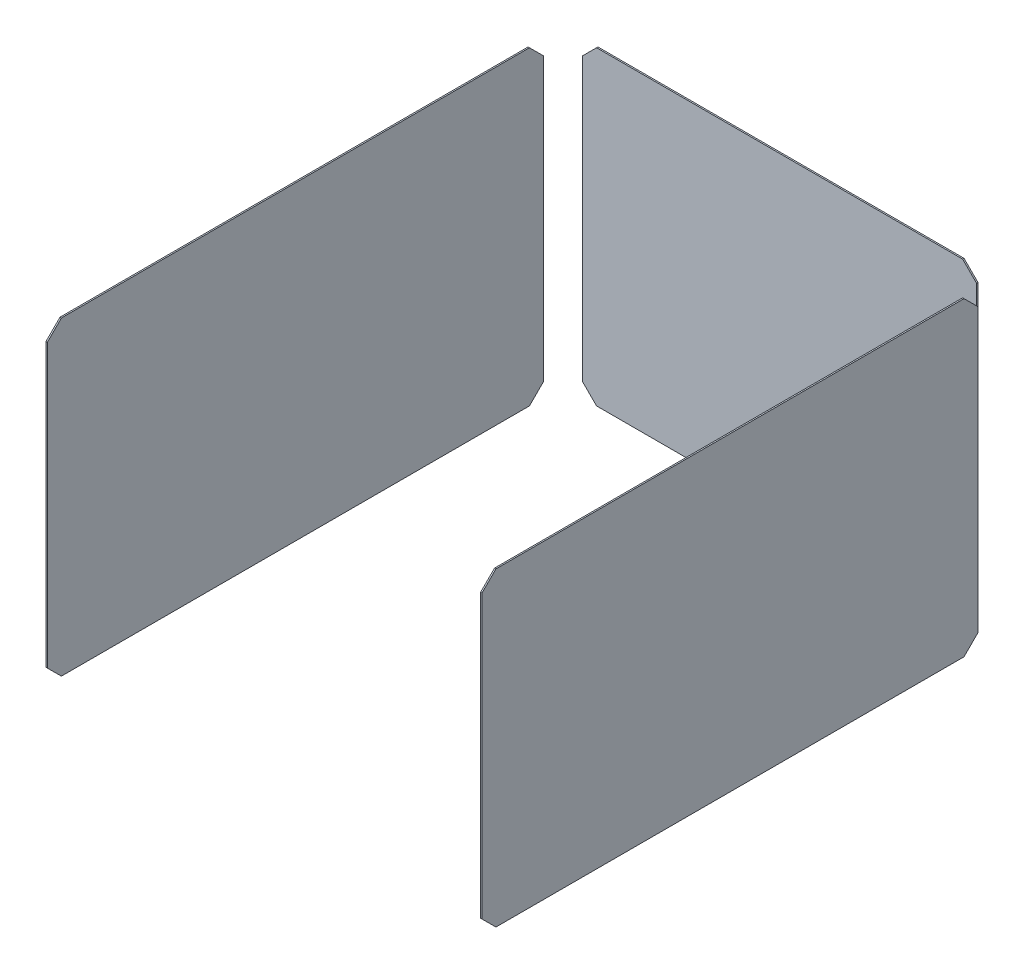
ISO-10303-21;
HEADER;
FILE_DESCRIPTION(('STEP AP214'),'2;1');
FILE_NAME('part.step','',(''),(''),'','','');
FILE_SCHEMA(('AUTOMOTIVE_DESIGN { 1 0 10303 214 1 1 1 1 }'));
ENDSEC;
DATA;
#1=APPLICATION_CONTEXT('core data for automotive mechanical design processes');
#2=APPLICATION_PROTOCOL_DEFINITION('international standard','automotive_design',2000,#1);
#3=PRODUCT_CONTEXT('',#1,'mechanical');
#4=PRODUCT('Part','Part','',(#3));
#5=PRODUCT_RELATED_PRODUCT_CATEGORY('part','',(#4));
#6=PRODUCT_DEFINITION_FORMATION('','',#4);
#7=PRODUCT_DEFINITION_CONTEXT('part definition',#1,'design');
#8=PRODUCT_DEFINITION('design','',#6,#7);
#9=PRODUCT_DEFINITION_SHAPE('','',#8);
#10=(LENGTH_UNIT() NAMED_UNIT(*) SI_UNIT(.MILLI.,.METRE.));
#11=(NAMED_UNIT(*) PLANE_ANGLE_UNIT() SI_UNIT($,.RADIAN.));
#12=(NAMED_UNIT(*) SI_UNIT($,.STERADIAN.) SOLID_ANGLE_UNIT());
#13=UNCERTAINTY_MEASURE_WITH_UNIT(LENGTH_MEASURE(1.E-05),#10,'distance_accuracy_value','');
#14=(GEOMETRIC_REPRESENTATION_CONTEXT(3) GLOBAL_UNCERTAINTY_ASSIGNED_CONTEXT((#13)) GLOBAL_UNIT_ASSIGNED_CONTEXT((#10,
#11,#12)) REPRESENTATION_CONTEXT('',''));
#15=CARTESIAN_POINT('',(0.,0.,0.));
#16=DIRECTION('',(0.,0.,1.));
#17=DIRECTION('',(1.,0.,0.));
#18=AXIS2_PLACEMENT_3D('',#15,#16,#17);
#19=CARTESIAN_POINT('',(3160.,2360.,-4000.));
#20=DIRECTION('',(0.,-1.,0.));
#21=DIRECTION('',(0.,0.,-1.));
#22=AXIS2_PLACEMENT_3D('',#19,#20,#21);
#23=PLANE('',#22);
#24=DIRECTION('',(0.,0.,-1.));
#25=VECTOR('',#24,1.);
#26=CARTESIAN_POINT('',(3110.,2360.,-3700.));
#27=LINE('',#26,#25);
#28=CARTESIAN_POINT('',(3110.,2360.,-100.));
#29=VERTEX_POINT('',#28);
#30=CARTESIAN_POINT('',(3110.,2360.,-3450.));
#31=VERTEX_POINT('',#30);
#32=EDGE_CURVE('E190',#29,#31,#27,.T.);
#33=ORIENTED_EDGE('',*,*,#32,.T.);
#34=DIRECTION('',(-1.,0.,0.));
#35=VECTOR('',#34,1.);
#36=CARTESIAN_POINT('',(3160.,2360.,-3450.));
#37=LINE('',#36,#35);
#38=CARTESIAN_POINT('',(3100.,2360.,-3450.));
#39=VERTEX_POINT('',#38);
#40=EDGE_CURVE('E181',#31,#39,#37,.T.);
#41=ORIENTED_EDGE('',*,*,#40,.T.);
#42=DIRECTION('',(0.,0.,-1.));
#43=VECTOR('',#42,1.);
#44=CARTESIAN_POINT('',(3100.,2360.,-3700.));
#45=LINE('',#44,#43);
#46=CARTESIAN_POINT('',(3100.,2360.,-99.9999999999994));
#47=VERTEX_POINT('',#46);
#48=EDGE_CURVE('E187',#47,#39,#45,.T.);
#49=ORIENTED_EDGE('',*,*,#48,.F.);
#50=DIRECTION('',(1.,0.,0.));
#51=VECTOR('',#50,1.);
#52=CARTESIAN_POINT('',(3110.,2360.,-100.));
#53=LINE('',#52,#51);
#54=EDGE_CURVE('E142',#47,#29,#53,.T.);
#55=ORIENTED_EDGE('',*,*,#54,.T.);
#56=EDGE_LOOP('',(#33,#41,#49,#55));
#57=FACE_BOUND('',#56,.T.);
#58=ADVANCED_FACE('F70',(#57),#23,.F.);
#59=CARTESIAN_POINT('',(-60.0000000000005,140.,-4000.));
#60=DIRECTION('',(0.,1.,0.));
#61=DIRECTION('',(0.,0.,1.));
#62=AXIS2_PLACEMENT_3D('',#59,#60,#61);
#63=PLANE('',#62);
#64=DIRECTION('',(0.,0.,1.));
#65=VECTOR('',#64,1.);
#66=CARTESIAN_POINT('',(3100.,140.,-3700.));
#67=LINE('',#66,#65);
#68=CARTESIAN_POINT('',(3100.,140.,-3450.));
#69=VERTEX_POINT('',#68);
#70=CARTESIAN_POINT('',(3100.,140.,-99.9999999999994));
#71=VERTEX_POINT('',#70);
#72=EDGE_CURVE('E136',#69,#71,#67,.T.);
#73=ORIENTED_EDGE('',*,*,#72,.F.);
#74=DIRECTION('',(1.,0.,0.));
#75=VECTOR('',#74,1.);
#76=CARTESIAN_POINT('',(-60.0000000000005,140.,-3450.));
#77=LINE('',#76,#75);
#78=CARTESIAN_POINT('',(3110.,140.,-3450.));
#79=VERTEX_POINT('',#78);
#80=EDGE_CURVE('E150',#69,#79,#77,.T.);
#81=ORIENTED_EDGE('',*,*,#80,.T.);
#82=DIRECTION('',(0.,0.,1.));
#83=VECTOR('',#82,1.);
#84=CARTESIAN_POINT('',(3110.,140.,-3700.));
#85=LINE('',#84,#83);
#86=CARTESIAN_POINT('',(3110.,140.,-100.));
#87=VERTEX_POINT('',#86);
#88=EDGE_CURVE('E207',#79,#87,#85,.T.);
#89=ORIENTED_EDGE('',*,*,#88,.T.);
#90=DIRECTION('',(-1.,0.,0.));
#91=VECTOR('',#90,1.);
#92=CARTESIAN_POINT('',(3100.,140.,-100.));
#93=LINE('',#92,#91);
#94=EDGE_CURVE('E153',#87,#71,#93,.T.);
#95=ORIENTED_EDGE('',*,*,#94,.T.);
#96=EDGE_LOOP('',(#73,#81,#89,#95));
#97=FACE_BOUND('',#96,.T.);
#98=ADVANCED_FACE('F148',(#97),#63,.F.);
#99=CARTESIAN_POINT('',(0.,0.,0.));
#100=DIRECTION('',(0.,0.,1.));
#101=DIRECTION('',(1.,0.,0.));
#102=AXIS2_PLACEMENT_3D('',#99,#100,#101);
#103=PLANE('',#102);
#104=DIRECTION('',(0.,1.,0.));
#105=VECTOR('',#104,1.);
#106=CARTESIAN_POINT('',(3100.,0.,0.));
#107=LINE('',#106,#105);
#108=CARTESIAN_POINT('',(3100.,240.,0.));
#109=VERTEX_POINT('',#108);
#110=CARTESIAN_POINT('',(3100.,2260.,0.));
#111=VERTEX_POINT('',#110);
#112=EDGE_CURVE('E154',#109,#111,#107,.T.);
#113=ORIENTED_EDGE('',*,*,#112,.F.);
#114=DIRECTION('',(1.,0.,0.));
#115=VECTOR('',#114,1.);
#116=CARTESIAN_POINT('',(3110.,240.,0.));
#117=LINE('',#116,#115);
#118=CARTESIAN_POINT('',(3110.,240.,-1.11022302462516E-13));
#119=VERTEX_POINT('',#118);
#120=EDGE_CURVE('E13',#109,#119,#117,.T.);
#121=ORIENTED_EDGE('',*,*,#120,.T.);
#122=DIRECTION('',(0.,1.,0.));
#123=VECTOR('',#122,1.);
#124=CARTESIAN_POINT('',(3110.,0.,0.));
#125=LINE('',#124,#123);
#126=CARTESIAN_POINT('',(3110.,2260.,0.));
#127=VERTEX_POINT('',#126);
#128=EDGE_CURVE('E194',#119,#127,#125,.T.);
#129=ORIENTED_EDGE('',*,*,#128,.T.);
#130=DIRECTION('',(-1.,0.,0.));
#131=VECTOR('',#130,1.);
#132=CARTESIAN_POINT('',(3100.,2260.,0.));
#133=LINE('',#132,#131);
#134=EDGE_CURVE('E78',#127,#111,#133,.T.);
#135=ORIENTED_EDGE('',*,*,#134,.T.);
#136=EDGE_LOOP('',(#113,#121,#129,#135));
#137=FACE_BOUND('',#136,.T.);
#138=ADVANCED_FACE('F215',(#137),#103,.T.);
#139=CARTESIAN_POINT('',(3100.,0.,-3700.));
#140=DIRECTION('',(1.,0.,0.));
#141=DIRECTION('',(0.,0.,-1.));
#142=AXIS2_PLACEMENT_3D('',#139,#140,#141);
#143=PLANE('',#142);
#144=DIRECTION('',(0.,-1.,0.));
#145=VECTOR('',#144,1.);
#146=CARTESIAN_POINT('',(3100.,0.,-3550.));
#147=LINE('',#146,#145);
#148=CARTESIAN_POINT('',(3100.,2260.,-3550.));
#149=VERTEX_POINT('',#148);
#150=CARTESIAN_POINT('',(3100.,240.000000000001,-3550.));
#151=VERTEX_POINT('',#150);
#152=EDGE_CURVE('E138',#149,#151,#147,.T.);
#153=ORIENTED_EDGE('',*,*,#152,.T.);
#154=DIRECTION('',(0.,0.707106781186551,-0.707106781186544));
#155=VECTOR('',#154,1.);
#156=CARTESIAN_POINT('',(3100.,140.,-3450.));
#157=LINE('',#156,#155);
#158=EDGE_CURVE('E133',#151,#69,#157,.F.);
#159=ORIENTED_EDGE('',*,*,#158,.T.);
#160=ORIENTED_EDGE('',*,*,#72,.T.);
#161=DIRECTION('',(0.,0.707106781186549,0.707106781186546));
#162=VECTOR('',#161,1.);
#163=CARTESIAN_POINT('',(3100.,140.,-100.));
#164=LINE('',#163,#162);
#165=EDGE_CURVE('E91',#71,#109,#164,.T.);
#166=ORIENTED_EDGE('',*,*,#165,.T.);
#167=ORIENTED_EDGE('',*,*,#112,.T.);
#168=DIRECTION('',(0.,0.707106781186549,-0.707106781186546));
#169=VECTOR('',#168,1.);
#170=CARTESIAN_POINT('',(3100.,2360.,-100.));
#171=LINE('',#170,#169);
#172=EDGE_CURVE('E175',#111,#47,#171,.T.);
#173=ORIENTED_EDGE('',*,*,#172,.T.);
#174=ORIENTED_EDGE('',*,*,#48,.T.);
#175=DIRECTION('',(0.,0.707106781186544,0.707106781186551));
#176=VECTOR('',#175,1.);
#177=CARTESIAN_POINT('',(3100.,2260.,-3550.));
#178=LINE('',#177,#176);
#179=EDGE_CURVE('E143',#39,#149,#178,.F.);
#180=ORIENTED_EDGE('',*,*,#179,.T.);
#181=EDGE_LOOP('',(#153,#159,#160,#166,#167,#173,#174,#180));
#182=FACE_BOUND('',#181,.T.);
#183=ADVANCED_FACE('F135',(#182),#143,.F.);
#184=CARTESIAN_POINT('',(3110.,0.,-3700.));
#185=DIRECTION('',(1.,0.,0.));
#186=DIRECTION('',(0.,0.,-1.));
#187=AXIS2_PLACEMENT_3D('',#184,#185,#186);
#188=PLANE('',#187);
#189=ORIENTED_EDGE('',*,*,#88,.F.);
#190=DIRECTION('',(0.,-0.707106781186551,0.707106781186544));
#191=VECTOR('',#190,1.);
#192=CARTESIAN_POINT('',(3110.,194.999999999999,-3505.));
#193=LINE('',#192,#191);
#194=CARTESIAN_POINT('',(3110.,240.000000000001,-3550.));
#195=VERTEX_POINT('',#194);
#196=EDGE_CURVE('E157',#79,#195,#193,.F.);
#197=ORIENTED_EDGE('',*,*,#196,.T.);
#198=DIRECTION('',(0.,-1.,0.));
#199=VECTOR('',#198,1.);
#200=CARTESIAN_POINT('',(3110.,0.,-3550.));
#201=LINE('',#200,#199);
#202=CARTESIAN_POINT('',(3110.,2260.,-3550.));
#203=VERTEX_POINT('',#202);
#204=EDGE_CURVE('E162',#203,#195,#201,.T.);
#205=ORIENTED_EDGE('',*,*,#204,.F.);
#206=DIRECTION('',(0.,-0.707106781186544,-0.707106781186551));
#207=VECTOR('',#206,1.);
#208=CARTESIAN_POINT('',(3110.,1055.00000000001,-4755.));
#209=LINE('',#208,#207);
#210=EDGE_CURVE('E167',#203,#31,#209,.F.);
#211=ORIENTED_EDGE('',*,*,#210,.T.);
#212=ORIENTED_EDGE('',*,*,#32,.F.);
#213=DIRECTION('',(0.,-0.707106781186549,0.707106781186546));
#214=VECTOR('',#213,1.);
#215=CARTESIAN_POINT('',(3110.,2979.99999999999,-719.999999999992));
#216=LINE('',#215,#214);
#217=EDGE_CURVE('E158',#29,#127,#216,.T.);
#218=ORIENTED_EDGE('',*,*,#217,.T.);
#219=ORIENTED_EDGE('',*,*,#128,.F.);
#220=DIRECTION('',(0.,-0.707106781186549,-0.707106781186546));
#221=VECTOR('',#220,1.);
#222=CARTESIAN_POINT('',(3110.,-1730.,-1969.99999999999));
#223=LINE('',#222,#221);
#224=EDGE_CURVE('E160',#119,#87,#223,.T.);
#225=ORIENTED_EDGE('',*,*,#224,.T.);
#226=EDGE_LOOP('',(#189,#197,#205,#211,#212,#218,#219,#225));
#227=FACE_BOUND('',#226,.T.);
#228=ADVANCED_FACE('F203',(#227),#188,.T.);
#229=CARTESIAN_POINT('',(3150.98855541731,-665.200000000001,-3550.));
#230=DIRECTION('',(0.,0.,1.));
#231=DIRECTION('',(1.,0.,0.));
#232=AXIS2_PLACEMENT_3D('',#229,#230,#231);
#233=PLANE('',#232);
#234=ORIENTED_EDGE('',*,*,#204,.T.);
#235=DIRECTION('',(-1.,0.,0.));
#236=VECTOR('',#235,1.);
#237=CARTESIAN_POINT('',(3150.98855541731,240.000000000001,-3550.));
#238=LINE('',#237,#236);
#239=EDGE_CURVE('E173',#195,#151,#238,.T.);
#240=ORIENTED_EDGE('',*,*,#239,.T.);
#241=ORIENTED_EDGE('',*,*,#152,.F.);
#242=DIRECTION('',(1.,0.,0.));
#243=VECTOR('',#242,1.);
#244=CARTESIAN_POINT('',(3150.98855541731,2260.,-3550.));
#245=LINE('',#244,#243);
#246=EDGE_CURVE('E170',#149,#203,#245,.T.);
#247=ORIENTED_EDGE('',*,*,#246,.T.);
#248=EDGE_LOOP('',(#234,#240,#241,#247));
#249=FACE_BOUND('',#248,.T.);
#250=ADVANCED_FACE('F201',(#249),#233,.F.);
#251=CARTESIAN_POINT('',(-60.0000000000005,140.,-3450.));
#252=DIRECTION('',(0.,0.707106781186544,0.707106781186551));
#253=DIRECTION('',(1.,0.,0.));
#254=AXIS2_PLACEMENT_3D('',#251,#252,#253);
#255=PLANE('',#254);
#256=ORIENTED_EDGE('',*,*,#158,.F.);
#257=ORIENTED_EDGE('',*,*,#239,.F.);
#258=ORIENTED_EDGE('',*,*,#196,.F.);
#259=ORIENTED_EDGE('',*,*,#80,.F.);
#260=EDGE_LOOP('',(#256,#257,#258,#259));
#261=FACE_BOUND('',#260,.T.);
#262=ADVANCED_FACE('F156',(#261),#255,.F.);
#263=CARTESIAN_POINT('',(3150.98855541731,2260.,-3550.));
#264=DIRECTION('',(0.,-0.707106781186551,0.707106781186544));
#265=DIRECTION('',(1.,0.,0.));
#266=AXIS2_PLACEMENT_3D('',#263,#264,#265);
#267=PLANE('',#266);
#268=ORIENTED_EDGE('',*,*,#179,.F.);
#269=ORIENTED_EDGE('',*,*,#40,.F.);
#270=ORIENTED_EDGE('',*,*,#210,.F.);
#271=ORIENTED_EDGE('',*,*,#246,.F.);
#272=EDGE_LOOP('',(#268,#269,#270,#271));
#273=FACE_BOUND('',#272,.T.);
#274=ADVANCED_FACE('F197',(#273),#267,.F.);
#275=CARTESIAN_POINT('',(-60.0000000000005,140.,-100.));
#276=DIRECTION('',(0.,-0.707106781186546,0.707106781186549));
#277=DIRECTION('',(1.,0.,0.));
#278=AXIS2_PLACEMENT_3D('',#275,#276,#277);
#279=PLANE('',#278);
#280=ORIENTED_EDGE('',*,*,#224,.F.);
#281=ORIENTED_EDGE('',*,*,#120,.F.);
#282=ORIENTED_EDGE('',*,*,#165,.F.);
#283=ORIENTED_EDGE('',*,*,#94,.F.);
#284=EDGE_LOOP('',(#280,#281,#282,#283));
#285=FACE_BOUND('',#284,.T.);
#286=ADVANCED_FACE('F212',(#285),#279,.T.);
#287=CARTESIAN_POINT('',(3160.,2360.,-100.));
#288=DIRECTION('',(0.,0.707106781186546,0.707106781186549));
#289=DIRECTION('',(-1.,0.,0.));
#290=AXIS2_PLACEMENT_3D('',#287,#288,#289);
#291=PLANE('',#290);
#292=ORIENTED_EDGE('',*,*,#172,.F.);
#293=ORIENTED_EDGE('',*,*,#134,.F.);
#294=ORIENTED_EDGE('',*,*,#217,.F.);
#295=ORIENTED_EDGE('',*,*,#54,.F.);
#296=EDGE_LOOP('',(#292,#293,#294,#295));
#297=FACE_BOUND('',#296,.T.);
#298=ADVANCED_FACE('F72',(#297),#291,.T.);
#299=CLOSED_SHELL('',(#58,#98,#138,#183,#228,#250,#262,#274,#286,#298));
#300=MANIFOLD_SOLID_BREP('B2',#299);
#301=CARTESIAN_POINT('',(140.,-665.200000000001,-3806.9958880207));
#302=DIRECTION('',(1.,0.,0.));
#303=DIRECTION('',(0.,0.,-1.));
#304=AXIS2_PLACEMENT_3D('',#301,#302,#303);
#305=PLANE('',#304);
#306=DIRECTION('',(0.,1.,0.));
#307=VECTOR('',#306,1.);
#308=CARTESIAN_POINT('',(140.,0.,-3700.));
#309=LINE('',#308,#307);
#310=CARTESIAN_POINT('',(140.,240.000000000001,-3700.));
#311=VERTEX_POINT('',#310);
#312=CARTESIAN_POINT('',(140.,2260.,-3700.));
#313=VERTEX_POINT('',#312);
#314=EDGE_CURVE('E405',#311,#313,#309,.T.);
#315=ORIENTED_EDGE('',*,*,#314,.F.);
#316=DIRECTION('',(0.,0.,1.));
#317=VECTOR('',#316,1.);
#318=CARTESIAN_POINT('',(140.,240.000000000001,-3806.9958880207));
#319=LINE('',#318,#317);
#320=CARTESIAN_POINT('',(140.,240.000000000001,-3690.));
#321=VERTEX_POINT('',#320);
#322=EDGE_CURVE('E68',#311,#321,#319,.T.);
#323=ORIENTED_EDGE('',*,*,#322,.T.);
#324=DIRECTION('',(0.,-1.,0.));
#325=VECTOR('',#324,1.);
#326=CARTESIAN_POINT('',(140.,0.,-3690.));
#327=LINE('',#326,#325);
#328=CARTESIAN_POINT('',(140.,2260.,-3690.));
#329=VERTEX_POINT('',#328);
#330=EDGE_CURVE('E435',#329,#321,#327,.T.);
#331=ORIENTED_EDGE('',*,*,#330,.F.);
#332=DIRECTION('',(0.,0.,-1.));
#333=VECTOR('',#332,1.);
#334=CARTESIAN_POINT('',(140.,2260.,-3806.9958880207));
#335=LINE('',#334,#333);
#336=EDGE_CURVE('E327',#329,#313,#335,.T.);
#337=ORIENTED_EDGE('',*,*,#336,.T.);
#338=EDGE_LOOP('',(#315,#323,#331,#337));
#339=FACE_BOUND('',#338,.T.);
#340=ADVANCED_FACE('F319',(#339),#305,.F.);
#341=CARTESIAN_POINT('',(0.,0.,-3690.));
#342=DIRECTION('',(0.,0.,-1.));
#343=DIRECTION('',(-1.,0.,0.));
#344=AXIS2_PLACEMENT_3D('',#341,#342,#343);
#345=PLANE('',#344);
#346=DIRECTION('',(1.,0.,0.));
#347=VECTOR('',#346,1.);
#348=CARTESIAN_POINT('',(0.,140.,-3690.));
#349=LINE('',#348,#347);
#350=CARTESIAN_POINT('',(240.,140.,-3690.));
#351=VERTEX_POINT('',#350);
#352=CARTESIAN_POINT('',(2860.,140.,-3690.));
#353=VERTEX_POINT('',#352);
#354=EDGE_CURVE('E445',#351,#353,#349,.T.);
#355=ORIENTED_EDGE('',*,*,#354,.T.);
#356=DIRECTION('',(-0.707106781186542,-0.707106781186553,0.));
#357=VECTOR('',#356,1.);
#358=CARTESIAN_POINT('',(2860.,140.,-3690.));
#359=LINE('',#358,#357);
#360=CARTESIAN_POINT('',(2960.,240.000000000001,-3690.));
#361=VERTEX_POINT('',#360);
#362=EDGE_CURVE('E408',#353,#361,#359,.F.);
#363=ORIENTED_EDGE('',*,*,#362,.T.);
#364=DIRECTION('',(0.,1.,0.));
#365=VECTOR('',#364,1.);
#366=CARTESIAN_POINT('',(2960.,0.,-3690.));
#367=LINE('',#366,#365);
#368=CARTESIAN_POINT('',(2960.,2260.,-3690.));
#369=VERTEX_POINT('',#368);
#370=EDGE_CURVE('E413',#361,#369,#367,.T.);
#371=ORIENTED_EDGE('',*,*,#370,.T.);
#372=DIRECTION('',(0.707106781186547,-0.707106781186548,0.));
#373=VECTOR('',#372,1.);
#374=CARTESIAN_POINT('',(2960.,2260.,-3690.));
#375=LINE('',#374,#373);
#376=CARTESIAN_POINT('',(2860.,2360.,-3690.));
#377=VERTEX_POINT('',#376);
#378=EDGE_CURVE('E418',#369,#377,#375,.F.);
#379=ORIENTED_EDGE('',*,*,#378,.T.);
#380=DIRECTION('',(-1.,0.,0.));
#381=VECTOR('',#380,1.);
#382=CARTESIAN_POINT('',(0.,2360.,-3690.));
#383=LINE('',#382,#381);
#384=CARTESIAN_POINT('',(240.,2360.,-3690.));
#385=VERTEX_POINT('',#384);
#386=EDGE_CURVE('E441',#377,#385,#383,.T.);
#387=ORIENTED_EDGE('',*,*,#386,.T.);
#388=DIRECTION('',(0.70710678118655,0.707106781186545,0.));
#389=VECTOR('',#388,1.);
#390=CARTESIAN_POINT('',(140.,2260.,-3690.));
#391=LINE('',#390,#389);
#392=EDGE_CURVE('E409',#385,#329,#391,.F.);
#393=ORIENTED_EDGE('',*,*,#392,.T.);
#394=ORIENTED_EDGE('',*,*,#330,.T.);
#395=DIRECTION('',(-0.707106781186544,0.707106781186551,0.));
#396=VECTOR('',#395,1.);
#397=CARTESIAN_POINT('',(240.,140.,-3690.));
#398=LINE('',#397,#396);
#399=EDGE_CURVE('E411',#321,#351,#398,.F.);
#400=ORIENTED_EDGE('',*,*,#399,.T.);
#401=EDGE_LOOP('',(#355,#363,#371,#379,#387,#393,#394,#400));
#402=FACE_BOUND('',#401,.T.);
#403=ADVANCED_FACE('F449',(#402),#345,.F.);
#404=CARTESIAN_POINT('',(0.,0.,-3700.));
#405=DIRECTION('',(0.,0.,1.));
#406=DIRECTION('',(1.,0.,0.));
#407=AXIS2_PLACEMENT_3D('',#404,#405,#406);
#408=PLANE('',#407);
#409=DIRECTION('',(0.,-1.,0.));
#410=VECTOR('',#409,1.);
#411=CARTESIAN_POINT('',(2960.,0.,-3700.));
#412=LINE('',#411,#410);
#413=CARTESIAN_POINT('',(2960.,2260.,-3700.));
#414=VERTEX_POINT('',#413);
#415=CARTESIAN_POINT('',(2960.,240.000000000001,-3700.));
#416=VERTEX_POINT('',#415);
#417=EDGE_CURVE('E389',#414,#416,#412,.T.);
#418=ORIENTED_EDGE('',*,*,#417,.T.);
#419=DIRECTION('',(0.707106781186542,0.707106781186553,0.));
#420=VECTOR('',#419,1.);
#421=CARTESIAN_POINT('',(2860.,140.,-3700.));
#422=LINE('',#421,#420);
#423=CARTESIAN_POINT('',(2860.,140.,-3700.));
#424=VERTEX_POINT('',#423);
#425=EDGE_CURVE('E384',#416,#424,#422,.F.);
#426=ORIENTED_EDGE('',*,*,#425,.T.);
#427=DIRECTION('',(-1.,0.,0.));
#428=VECTOR('',#427,1.);
#429=CARTESIAN_POINT('',(0.,140.,-3700.));
#430=LINE('',#429,#428);
#431=CARTESIAN_POINT('',(240.,140.,-3700.));
#432=VERTEX_POINT('',#431);
#433=EDGE_CURVE('E387',#424,#432,#430,.T.);
#434=ORIENTED_EDGE('',*,*,#433,.T.);
#435=DIRECTION('',(0.707106781186544,-0.707106781186551,0.));
#436=VECTOR('',#435,1.);
#437=CARTESIAN_POINT('',(240.,140.,-3700.));
#438=LINE('',#437,#436);
#439=EDGE_CURVE('E342',#432,#311,#438,.F.);
#440=ORIENTED_EDGE('',*,*,#439,.T.);
#441=ORIENTED_EDGE('',*,*,#314,.T.);
#442=DIRECTION('',(-0.70710678118655,-0.707106781186545,0.));
#443=VECTOR('',#442,1.);
#444=CARTESIAN_POINT('',(140.,2260.,-3700.));
#445=LINE('',#444,#443);
#446=CARTESIAN_POINT('',(240.,2360.,-3700.));
#447=VERTEX_POINT('',#446);
#448=EDGE_CURVE('E334',#313,#447,#445,.F.);
#449=ORIENTED_EDGE('',*,*,#448,.T.);
#450=DIRECTION('',(1.,0.,0.));
#451=VECTOR('',#450,1.);
#452=CARTESIAN_POINT('',(0.,2360.,-3700.));
#453=LINE('',#452,#451);
#454=CARTESIAN_POINT('',(2860.,2360.,-3700.));
#455=VERTEX_POINT('',#454);
#456=EDGE_CURVE('E439',#447,#455,#453,.T.);
#457=ORIENTED_EDGE('',*,*,#456,.T.);
#458=DIRECTION('',(-0.707106781186547,0.707106781186548,0.));
#459=VECTOR('',#458,1.);
#460=CARTESIAN_POINT('',(2960.,2260.,-3700.));
#461=LINE('',#460,#459);
#462=EDGE_CURVE('E394',#455,#414,#461,.F.);
#463=ORIENTED_EDGE('',*,*,#462,.T.);
#464=EDGE_LOOP('',(#418,#426,#434,#440,#441,#449,#457,#463));
#465=FACE_BOUND('',#464,.T.);
#466=ADVANCED_FACE('F386',(#465),#408,.F.);
#467=CARTESIAN_POINT('',(-60.0000000000005,140.,-4000.));
#468=DIRECTION('',(0.,1.,0.));
#469=DIRECTION('',(0.,0.,1.));
#470=AXIS2_PLACEMENT_3D('',#467,#468,#469);
#471=PLANE('',#470);
#472=ORIENTED_EDGE('',*,*,#433,.F.);
#473=DIRECTION('',(0.,0.,1.));
#474=VECTOR('',#473,1.);
#475=CARTESIAN_POINT('',(2860.,140.,-3999.99999999999));
#476=LINE('',#475,#474);
#477=EDGE_CURVE('E401',#424,#353,#476,.T.);
#478=ORIENTED_EDGE('',*,*,#477,.T.);
#479=ORIENTED_EDGE('',*,*,#354,.F.);
#480=DIRECTION('',(0.,0.,-1.));
#481=VECTOR('',#480,1.);
#482=CARTESIAN_POINT('',(240.,140.,-4000.));
#483=LINE('',#482,#481);
#484=EDGE_CURVE('E404',#351,#432,#483,.T.);
#485=ORIENTED_EDGE('',*,*,#484,.T.);
#486=EDGE_LOOP('',(#472,#478,#479,#485));
#487=FACE_BOUND('',#486,.T.);
#488=ADVANCED_FACE('F399',(#487),#471,.F.);
#489=CARTESIAN_POINT('',(3160.,2360.,-4000.));
#490=DIRECTION('',(0.,-1.,0.));
#491=DIRECTION('',(0.,0.,-1.));
#492=AXIS2_PLACEMENT_3D('',#489,#490,#491);
#493=PLANE('',#492);
#494=ORIENTED_EDGE('',*,*,#386,.F.);
#495=DIRECTION('',(0.,0.,-1.));
#496=VECTOR('',#495,1.);
#497=CARTESIAN_POINT('',(2860.,2360.,-4000.));
#498=LINE('',#497,#496);
#499=EDGE_CURVE('E430',#377,#455,#498,.T.);
#500=ORIENTED_EDGE('',*,*,#499,.T.);
#501=ORIENTED_EDGE('',*,*,#456,.F.);
#502=DIRECTION('',(0.,0.,1.));
#503=VECTOR('',#502,1.);
#504=CARTESIAN_POINT('',(240.,2360.,-4000.));
#505=LINE('',#504,#503);
#506=EDGE_CURVE('E393',#447,#385,#505,.T.);
#507=ORIENTED_EDGE('',*,*,#506,.T.);
#508=EDGE_LOOP('',(#494,#500,#501,#507));
#509=FACE_BOUND('',#508,.T.);
#510=ADVANCED_FACE('F456',(#509),#493,.F.);
#511=CARTESIAN_POINT('',(2960.,-665.200000000001,-3806.9958880207));
#512=DIRECTION('',(-1.,0.,0.));
#513=DIRECTION('',(0.,0.,1.));
#514=AXIS2_PLACEMENT_3D('',#511,#512,#513);
#515=PLANE('',#514);
#516=ORIENTED_EDGE('',*,*,#370,.F.);
#517=DIRECTION('',(0.,0.,-1.));
#518=VECTOR('',#517,1.);
#519=CARTESIAN_POINT('',(2960.,240.000000000001,-3806.9958880207));
#520=LINE('',#519,#518);
#521=EDGE_CURVE('E424',#361,#416,#520,.T.);
#522=ORIENTED_EDGE('',*,*,#521,.T.);
#523=ORIENTED_EDGE('',*,*,#417,.F.);
#524=DIRECTION('',(0.,0.,1.));
#525=VECTOR('',#524,1.);
#526=CARTESIAN_POINT('',(2960.,2260.,-3806.9958880207));
#527=LINE('',#526,#525);
#528=EDGE_CURVE('E421',#414,#369,#527,.T.);
#529=ORIENTED_EDGE('',*,*,#528,.T.);
#530=EDGE_LOOP('',(#516,#522,#523,#529));
#531=FACE_BOUND('',#530,.T.);
#532=ADVANCED_FACE('F463',(#531),#515,.F.);
#533=CARTESIAN_POINT('',(2860.,140.,-3999.99999999999));
#534=DIRECTION('',(-0.707106781186553,0.707106781186542,0.));
#535=DIRECTION('',(0.,0.,1.));
#536=AXIS2_PLACEMENT_3D('',#533,#534,#535);
#537=PLANE('',#536);
#538=ORIENTED_EDGE('',*,*,#425,.F.);
#539=ORIENTED_EDGE('',*,*,#521,.F.);
#540=ORIENTED_EDGE('',*,*,#362,.F.);
#541=ORIENTED_EDGE('',*,*,#477,.F.);
#542=EDGE_LOOP('',(#538,#539,#540,#541));
#543=FACE_BOUND('',#542,.T.);
#544=ADVANCED_FACE('F407',(#543),#537,.F.);
#545=CARTESIAN_POINT('',(2960.,2260.,-3806.9958880207));
#546=DIRECTION('',(-0.707106781186548,-0.707106781186547,0.));
#547=DIRECTION('',(0.,0.,1.));
#548=AXIS2_PLACEMENT_3D('',#545,#546,#547);
#549=PLANE('',#548);
#550=ORIENTED_EDGE('',*,*,#462,.F.);
#551=ORIENTED_EDGE('',*,*,#499,.F.);
#552=ORIENTED_EDGE('',*,*,#378,.F.);
#553=ORIENTED_EDGE('',*,*,#528,.F.);
#554=EDGE_LOOP('',(#550,#551,#552,#553));
#555=FACE_BOUND('',#554,.T.);
#556=ADVANCED_FACE('F461',(#555),#549,.F.);
#557=CARTESIAN_POINT('',(240.,140.,-4000.));
#558=DIRECTION('',(0.707106781186551,0.707106781186544,0.));
#559=DIRECTION('',(0.,0.,-1.));
#560=AXIS2_PLACEMENT_3D('',#557,#558,#559);
#561=PLANE('',#560);
#562=ORIENTED_EDGE('',*,*,#399,.F.);
#563=ORIENTED_EDGE('',*,*,#322,.F.);
#564=ORIENTED_EDGE('',*,*,#439,.F.);
#565=ORIENTED_EDGE('',*,*,#484,.F.);
#566=EDGE_LOOP('',(#562,#563,#564,#565));
#567=FACE_BOUND('',#566,.T.);
#568=ADVANCED_FACE('F452',(#567),#561,.F.);
#569=CARTESIAN_POINT('',(140.,2260.,-3806.9958880207));
#570=DIRECTION('',(0.707106781186545,-0.70710678118655,0.));
#571=DIRECTION('',(0.,0.,-1.));
#572=AXIS2_PLACEMENT_3D('',#569,#570,#571);
#573=PLANE('',#572);
#574=ORIENTED_EDGE('',*,*,#392,.F.);
#575=ORIENTED_EDGE('',*,*,#506,.F.);
#576=ORIENTED_EDGE('',*,*,#448,.F.);
#577=ORIENTED_EDGE('',*,*,#336,.F.);
#578=EDGE_LOOP('',(#574,#575,#576,#577));
#579=FACE_BOUND('',#578,.T.);
#580=ADVANCED_FACE('F321',(#579),#573,.F.);
#581=CLOSED_SHELL('',(#340,#403,#466,#488,#510,#532,#544,#556,#568,#580));
#582=MANIFOLD_SOLID_BREP('B7',#581);
#583=CARTESIAN_POINT('',(0.,0.,0.));
#584=DIRECTION('',(0.,0.,1.));
#585=DIRECTION('',(1.,0.,0.));
#586=AXIS2_PLACEMENT_3D('',#583,#584,#585);
#587=PLANE('',#586);
#588=DIRECTION('',(0.,-1.,0.));
#589=VECTOR('',#588,1.);
#590=CARTESIAN_POINT('',(-10.,0.,0.));
#591=LINE('',#590,#589);
#592=CARTESIAN_POINT('',(-10.,2260.,-1.11022302462516E-13));
#593=VERTEX_POINT('',#592);
#594=CARTESIAN_POINT('',(-10.,240.,0.));
#595=VERTEX_POINT('',#594);
#596=EDGE_CURVE('E661',#593,#595,#591,.T.);
#597=ORIENTED_EDGE('',*,*,#596,.T.);
#598=DIRECTION('',(1.,0.,0.));
#599=VECTOR('',#598,1.);
#600=CARTESIAN_POINT('',(0.,240.,0.));
#601=LINE('',#600,#599);
#602=CARTESIAN_POINT('',(0.,240.,0.));
#603=VERTEX_POINT('',#602);
#604=EDGE_CURVE('E633',#595,#603,#601,.T.);
#605=ORIENTED_EDGE('',*,*,#604,.T.);
#606=DIRECTION('',(0.,-1.,0.));
#607=VECTOR('',#606,1.);
#608=CARTESIAN_POINT('',(0.,0.,0.));
#609=LINE('',#608,#607);
#610=CARTESIAN_POINT('',(0.,2260.,0.));
#611=VERTEX_POINT('',#610);
#612=EDGE_CURVE('E667',#611,#603,#609,.T.);
#613=ORIENTED_EDGE('',*,*,#612,.F.);
#614=DIRECTION('',(-1.,0.,0.));
#615=VECTOR('',#614,1.);
#616=CARTESIAN_POINT('',(-9.99999999999979,2260.,0.));
#617=LINE('',#616,#615);
#618=EDGE_CURVE('E638',#611,#593,#617,.T.);
#619=ORIENTED_EDGE('',*,*,#618,.T.);
#620=EDGE_LOOP('',(#597,#605,#613,#619));
#621=FACE_BOUND('',#620,.T.);
#622=ADVANCED_FACE('F562',(#621),#587,.T.);
#623=CARTESIAN_POINT('',(3160.,2360.,-4000.));
#624=DIRECTION('',(0.,-1.,0.));
#625=DIRECTION('',(0.,0.,-1.));
#626=AXIS2_PLACEMENT_3D('',#623,#624,#625);
#627=PLANE('',#626);
#628=DIRECTION('',(0.,0.,1.));
#629=VECTOR('',#628,1.);
#630=CARTESIAN_POINT('',(-10.,2360.,-3700.));
#631=LINE('',#630,#629);
#632=CARTESIAN_POINT('',(-10.,2360.,-3450.));
#633=VERTEX_POINT('',#632);
#634=CARTESIAN_POINT('',(-10.,2360.,-100.));
#635=VERTEX_POINT('',#634);
#636=EDGE_CURVE('E657',#633,#635,#631,.T.);
#637=ORIENTED_EDGE('',*,*,#636,.T.);
#638=DIRECTION('',(1.,0.,0.));
#639=VECTOR('',#638,1.);
#640=CARTESIAN_POINT('',(0.,2360.,-100.));
#641=LINE('',#640,#639);
#642=CARTESIAN_POINT('',(0.,2360.,-99.9999999999994));
#643=VERTEX_POINT('',#642);
#644=EDGE_CURVE('E682',#635,#643,#641,.T.);
#645=ORIENTED_EDGE('',*,*,#644,.T.);
#646=DIRECTION('',(0.,0.,1.));
#647=VECTOR('',#646,1.);
#648=CARTESIAN_POINT('',(0.,2360.,-3700.));
#649=LINE('',#648,#647);
#650=CARTESIAN_POINT('',(0.,2360.,-3450.));
#651=VERTEX_POINT('',#650);
#652=EDGE_CURVE('E666',#651,#643,#649,.T.);
#653=ORIENTED_EDGE('',*,*,#652,.F.);
#654=DIRECTION('',(-1.,0.,0.));
#655=VECTOR('',#654,1.);
#656=CARTESIAN_POINT('',(3160.,2360.,-3450.));
#657=LINE('',#656,#655);
#658=EDGE_CURVE('E680',#651,#633,#657,.T.);
#659=ORIENTED_EDGE('',*,*,#658,.T.);
#660=EDGE_LOOP('',(#637,#645,#653,#659));
#661=FACE_BOUND('',#660,.T.);
#662=ADVANCED_FACE('F705',(#661),#627,.F.);
#663=CARTESIAN_POINT('',(-60.0000000000005,140.,-4000.));
#664=DIRECTION('',(0.,1.,0.));
#665=DIRECTION('',(0.,0.,1.));
#666=AXIS2_PLACEMENT_3D('',#663,#664,#665);
#667=PLANE('',#666);
#668=DIRECTION('',(0.,0.,-1.));
#669=VECTOR('',#668,1.);
#670=CARTESIAN_POINT('',(0.,140.,-3700.));
#671=LINE('',#670,#669);
#672=CARTESIAN_POINT('',(0.,140.,-99.9999999999994));
#673=VERTEX_POINT('',#672);
#674=CARTESIAN_POINT('',(0.,140.,-3450.));
#675=VERTEX_POINT('',#674);
#676=EDGE_CURVE('E649',#673,#675,#671,.T.);
#677=ORIENTED_EDGE('',*,*,#676,.F.);
#678=DIRECTION('',(-1.,0.,0.));
#679=VECTOR('',#678,1.);
#680=CARTESIAN_POINT('',(-10.,140.,-100.));
#681=LINE('',#680,#679);
#682=CARTESIAN_POINT('',(-10.,140.,-100.));
#683=VERTEX_POINT('',#682);
#684=EDGE_CURVE('E632',#673,#683,#681,.T.);
#685=ORIENTED_EDGE('',*,*,#684,.T.);
#686=DIRECTION('',(0.,0.,-1.));
#687=VECTOR('',#686,1.);
#688=CARTESIAN_POINT('',(-10.,140.,-3700.));
#689=LINE('',#688,#687);
#690=CARTESIAN_POINT('',(-10.,140.,-3450.));
#691=VERTEX_POINT('',#690);
#692=EDGE_CURVE('E646',#683,#691,#689,.T.);
#693=ORIENTED_EDGE('',*,*,#692,.T.);
#694=DIRECTION('',(1.,0.,0.));
#695=VECTOR('',#694,1.);
#696=CARTESIAN_POINT('',(-60.0000000000005,140.,-3450.));
#697=LINE('',#696,#695);
#698=EDGE_CURVE('E651',#691,#675,#697,.T.);
#699=ORIENTED_EDGE('',*,*,#698,.T.);
#700=EDGE_LOOP('',(#677,#685,#693,#699));
#701=FACE_BOUND('',#700,.T.);
#702=ADVANCED_FACE('F644',(#701),#667,.F.);
#703=CARTESIAN_POINT('',(-10.,0.,-3700.));
#704=DIRECTION('',(-1.,0.,0.));
#705=DIRECTION('',(0.,0.,1.));
#706=AXIS2_PLACEMENT_3D('',#703,#704,#705);
#707=PLANE('',#706);
#708=ORIENTED_EDGE('',*,*,#692,.F.);
#709=DIRECTION('',(0.,0.707106781186549,0.707106781186546));
#710=VECTOR('',#709,1.);
#711=CARTESIAN_POINT('',(-10.,-1730.,-1969.99999999999));
#712=LINE('',#711,#710);
#713=EDGE_CURVE('E628',#683,#595,#712,.T.);
#714=ORIENTED_EDGE('',*,*,#713,.T.);
#715=ORIENTED_EDGE('',*,*,#596,.F.);
#716=DIRECTION('',(0.,0.707106781186549,-0.707106781186546));
#717=VECTOR('',#716,1.);
#718=CARTESIAN_POINT('',(-10.,2979.99999999999,-719.999999999992));
#719=LINE('',#718,#717);
#720=EDGE_CURVE('E639',#593,#635,#719,.T.);
#721=ORIENTED_EDGE('',*,*,#720,.T.);
#722=ORIENTED_EDGE('',*,*,#636,.F.);
#723=DIRECTION('',(0.,0.707106781186544,0.707106781186551));
#724=VECTOR('',#723,1.);
#725=CARTESIAN_POINT('',(-10.,1055.00000000001,-4755.));
#726=LINE('',#725,#724);
#727=CARTESIAN_POINT('',(-10.,2260.,-3550.));
#728=VERTEX_POINT('',#727);
#729=EDGE_CURVE('E650',#633,#728,#726,.F.);
#730=ORIENTED_EDGE('',*,*,#729,.T.);
#731=DIRECTION('',(0.,1.,0.));
#732=VECTOR('',#731,1.);
#733=CARTESIAN_POINT('',(-10.,0.,-3550.));
#734=LINE('',#733,#732);
#735=CARTESIAN_POINT('',(-10.,240.,-3550.));
#736=VERTEX_POINT('',#735);
#737=EDGE_CURVE('E691',#736,#728,#734,.T.);
#738=ORIENTED_EDGE('',*,*,#737,.F.);
#739=DIRECTION('',(0.,0.707106781186551,-0.707106781186544));
#740=VECTOR('',#739,1.);
#741=CARTESIAN_POINT('',(-10.,194.999999999999,-3505.));
#742=LINE('',#741,#740);
#743=EDGE_CURVE('E656',#736,#691,#742,.F.);
#744=ORIENTED_EDGE('',*,*,#743,.T.);
#745=EDGE_LOOP('',(#708,#714,#715,#721,#722,#730,#738,#744));
#746=FACE_BOUND('',#745,.T.);
#747=ADVANCED_FACE('F653',(#746),#707,.T.);
#748=CARTESIAN_POINT('',(0.,0.,-3700.));
#749=DIRECTION('',(-1.,0.,0.));
#750=DIRECTION('',(0.,0.,1.));
#751=AXIS2_PLACEMENT_3D('',#748,#749,#750);
#752=PLANE('',#751);
#753=ORIENTED_EDGE('',*,*,#612,.T.);
#754=DIRECTION('',(0.,-0.707106781186549,-0.707106781186546));
#755=VECTOR('',#754,1.);
#756=CARTESIAN_POINT('',(0.,140.,-100.));
#757=LINE('',#756,#755);
#758=EDGE_CURVE('E678',#603,#673,#757,.T.);
#759=ORIENTED_EDGE('',*,*,#758,.T.);
#760=ORIENTED_EDGE('',*,*,#676,.T.);
#761=DIRECTION('',(0.,-0.707106781186551,0.707106781186544));
#762=VECTOR('',#761,1.);
#763=CARTESIAN_POINT('',(0.,140.,-3450.));
#764=LINE('',#763,#762);
#765=CARTESIAN_POINT('',(0.,240.000000000001,-3550.));
#766=VERTEX_POINT('',#765);
#767=EDGE_CURVE('E675',#675,#766,#764,.F.);
#768=ORIENTED_EDGE('',*,*,#767,.T.);
#769=DIRECTION('',(0.,1.,0.));
#770=VECTOR('',#769,1.);
#771=CARTESIAN_POINT('',(0.,0.,-3550.));
#772=LINE('',#771,#770);
#773=CARTESIAN_POINT('',(0.,2260.,-3550.));
#774=VERTEX_POINT('',#773);
#775=EDGE_CURVE('E689',#766,#774,#772,.T.);
#776=ORIENTED_EDGE('',*,*,#775,.T.);
#777=DIRECTION('',(0.,-0.707106781186544,-0.707106781186551));
#778=VECTOR('',#777,1.);
#779=CARTESIAN_POINT('',(0.,2260.,-3550.));
#780=LINE('',#779,#778);
#781=EDGE_CURVE('E585',#774,#651,#780,.F.);
#782=ORIENTED_EDGE('',*,*,#781,.T.);
#783=ORIENTED_EDGE('',*,*,#652,.T.);
#784=DIRECTION('',(0.,-0.707106781186549,0.707106781186546));
#785=VECTOR('',#784,1.);
#786=CARTESIAN_POINT('',(0.,2360.,-100.));
#787=LINE('',#786,#785);
#788=EDGE_CURVE('E577',#643,#611,#787,.T.);
#789=ORIENTED_EDGE('',*,*,#788,.T.);
#790=EDGE_LOOP('',(#753,#759,#760,#768,#776,#782,#783,#789));
#791=FACE_BOUND('',#790,.T.);
#792=ADVANCED_FACE('F695',(#791),#752,.F.);
#793=CARTESIAN_POINT('',(-50.9885554173059,-665.200000000001,-3550.));
#794=DIRECTION('',(0.,0.,1.));
#795=DIRECTION('',(1.,0.,0.));
#796=AXIS2_PLACEMENT_3D('',#793,#794,#795);
#797=PLANE('',#796);
#798=ORIENTED_EDGE('',*,*,#775,.F.);
#799=DIRECTION('',(-1.,0.,0.));
#800=VECTOR('',#799,1.);
#801=CARTESIAN_POINT('',(-50.9885554173059,240.000000000001,-3550.));
#802=LINE('',#801,#800);
#803=EDGE_CURVE('E317',#766,#736,#802,.T.);
#804=ORIENTED_EDGE('',*,*,#803,.T.);
#805=ORIENTED_EDGE('',*,*,#737,.T.);
#806=DIRECTION('',(1.,0.,0.));
#807=VECTOR('',#806,1.);
#808=CARTESIAN_POINT('',(-50.9885554173059,2260.,-3550.));
#809=LINE('',#808,#807);
#810=EDGE_CURVE('E570',#728,#774,#809,.T.);
#811=ORIENTED_EDGE('',*,*,#810,.T.);
#812=EDGE_LOOP('',(#798,#804,#805,#811));
#813=FACE_BOUND('',#812,.T.);
#814=ADVANCED_FACE('F688',(#813),#797,.F.);
#815=CARTESIAN_POINT('',(-60.0000000000005,140.,-100.));
#816=DIRECTION('',(0.,-0.707106781186546,0.707106781186549));
#817=DIRECTION('',(1.,0.,0.));
#818=AXIS2_PLACEMENT_3D('',#815,#816,#817);
#819=PLANE('',#818);
#820=ORIENTED_EDGE('',*,*,#758,.F.);
#821=ORIENTED_EDGE('',*,*,#604,.F.);
#822=ORIENTED_EDGE('',*,*,#713,.F.);
#823=ORIENTED_EDGE('',*,*,#684,.F.);
#824=EDGE_LOOP('',(#820,#821,#822,#823));
#825=FACE_BOUND('',#824,.T.);
#826=ADVANCED_FACE('F631',(#825),#819,.T.);
#827=CARTESIAN_POINT('',(3160.,2360.,-100.));
#828=DIRECTION('',(0.,0.707106781186546,0.707106781186549));
#829=DIRECTION('',(-1.,0.,0.));
#830=AXIS2_PLACEMENT_3D('',#827,#828,#829);
#831=PLANE('',#830);
#832=ORIENTED_EDGE('',*,*,#720,.F.);
#833=ORIENTED_EDGE('',*,*,#618,.F.);
#834=ORIENTED_EDGE('',*,*,#788,.F.);
#835=ORIENTED_EDGE('',*,*,#644,.F.);
#836=EDGE_LOOP('',(#832,#833,#834,#835));
#837=FACE_BOUND('',#836,.T.);
#838=ADVANCED_FACE('F703',(#837),#831,.T.);
#839=CARTESIAN_POINT('',(-60.0000000000005,140.,-3450.));
#840=DIRECTION('',(0.,0.707106781186544,0.707106781186551));
#841=DIRECTION('',(1.,0.,0.));
#842=AXIS2_PLACEMENT_3D('',#839,#840,#841);
#843=PLANE('',#842);
#844=ORIENTED_EDGE('',*,*,#743,.F.);
#845=ORIENTED_EDGE('',*,*,#803,.F.);
#846=ORIENTED_EDGE('',*,*,#767,.F.);
#847=ORIENTED_EDGE('',*,*,#698,.F.);
#848=EDGE_LOOP('',(#844,#845,#846,#847));
#849=FACE_BOUND('',#848,.T.);
#850=ADVANCED_FACE('F708',(#849),#843,.F.);
#851=CARTESIAN_POINT('',(-50.9885554173059,2260.,-3550.));
#852=DIRECTION('',(0.,-0.707106781186551,0.707106781186544));
#853=DIRECTION('',(1.,0.,0.));
#854=AXIS2_PLACEMENT_3D('',#851,#852,#853);
#855=PLANE('',#854);
#856=ORIENTED_EDGE('',*,*,#729,.F.);
#857=ORIENTED_EDGE('',*,*,#658,.F.);
#858=ORIENTED_EDGE('',*,*,#781,.F.);
#859=ORIENTED_EDGE('',*,*,#810,.F.);
#860=EDGE_LOOP('',(#856,#857,#858,#859));
#861=FACE_BOUND('',#860,.T.);
#862=ADVANCED_FACE('F564',(#861),#855,.F.);
#863=CLOSED_SHELL('',(#622,#662,#702,#747,#792,#814,#826,#838,#850,#862));
#864=MANIFOLD_SOLID_BREP('B62',#863);
#865=ADVANCED_BREP_SHAPE_REPRESENTATION('',(#18,#300,#582,#864),#14);
#866=SHAPE_DEFINITION_REPRESENTATION(#9,#865);
ENDSEC;
END-ISO-10303-21;
